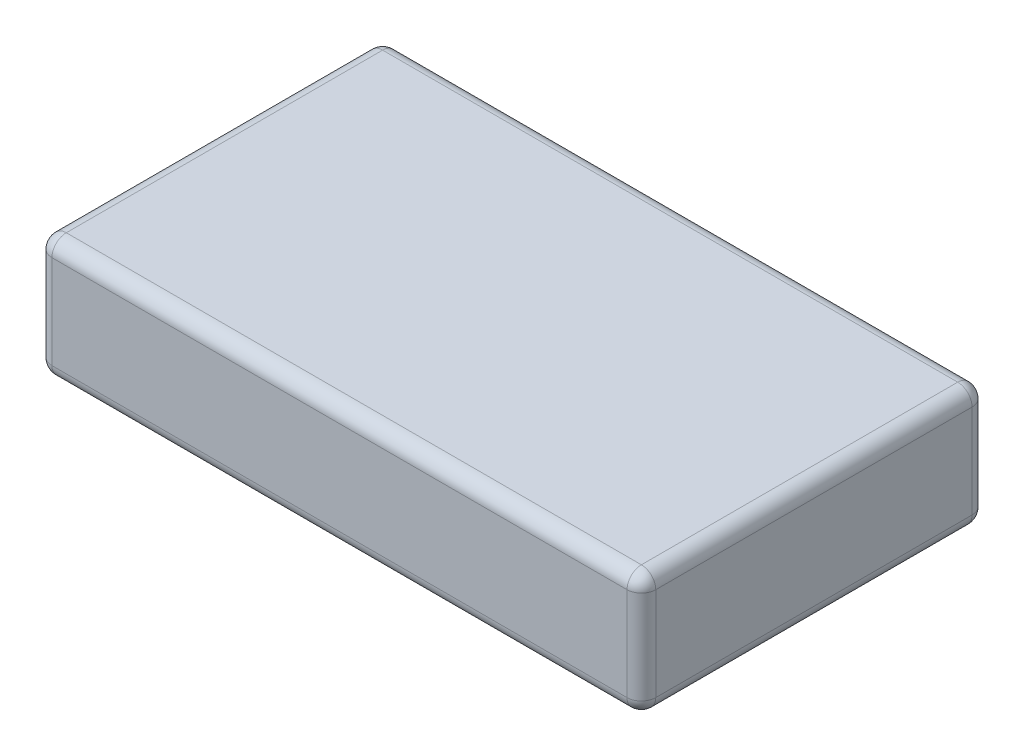
ISO-10303-21;
HEADER;
FILE_DESCRIPTION(('STEP AP214'),'2;1');
FILE_NAME('part.step','',(''),(''),'','','');
FILE_SCHEMA(('AUTOMOTIVE_DESIGN { 1 0 10303 214 1 1 1 1 }'));
ENDSEC;
DATA;
#1=APPLICATION_CONTEXT('core data for automotive mechanical design processes');
#2=APPLICATION_PROTOCOL_DEFINITION('international standard','automotive_design',2000,#1);
#3=PRODUCT_CONTEXT('',#1,'mechanical');
#4=PRODUCT('Part','Part','',(#3));
#5=PRODUCT_RELATED_PRODUCT_CATEGORY('part','',(#4));
#6=PRODUCT_DEFINITION_FORMATION('','',#4);
#7=PRODUCT_DEFINITION_CONTEXT('part definition',#1,'design');
#8=PRODUCT_DEFINITION('design','',#6,#7);
#9=PRODUCT_DEFINITION_SHAPE('','',#8);
#10=(LENGTH_UNIT() NAMED_UNIT(*) SI_UNIT(.MILLI.,.METRE.));
#11=(NAMED_UNIT(*) PLANE_ANGLE_UNIT() SI_UNIT($,.RADIAN.));
#12=(NAMED_UNIT(*) SI_UNIT($,.STERADIAN.) SOLID_ANGLE_UNIT());
#13=UNCERTAINTY_MEASURE_WITH_UNIT(LENGTH_MEASURE(1.E-05),#10,'distance_accuracy_value','');
#14=(GEOMETRIC_REPRESENTATION_CONTEXT(3) GLOBAL_UNCERTAINTY_ASSIGNED_CONTEXT((#13)) GLOBAL_UNIT_ASSIGNED_CONTEXT((#10,
#11,#12)) REPRESENTATION_CONTEXT('',''));
#15=CARTESIAN_POINT('',(0.,0.,0.));
#16=DIRECTION('',(0.,0.,1.));
#17=DIRECTION('',(1.,0.,0.));
#18=AXIS2_PLACEMENT_3D('',#15,#16,#17);
#19=CARTESIAN_POINT('',(-21.,8.5,-12.));
#20=DIRECTION('',(1.,0.,0.));
#21=DIRECTION('',(0.,0.,-1.));
#22=AXIS2_PLACEMENT_3D('',#19,#20,#21);
#23=PLANE('',#22);
#24=DIRECTION('',(0.,-1.,0.));
#25=VECTOR('',#24,1.);
#26=CARTESIAN_POINT('',(-21.,8.5,-11.));
#27=LINE('',#26,#25);
#28=CARTESIAN_POINT('',(-21.,7.5,-11.));
#29=VERTEX_POINT('',#28);
#30=CARTESIAN_POINT('',(-21.,1.,-11.));
#31=VERTEX_POINT('',#30);
#32=EDGE_CURVE('E277',#29,#31,#27,.T.);
#33=ORIENTED_EDGE('',*,*,#32,.T.);
#34=DIRECTION('',(0.,0.,1.));
#35=VECTOR('',#34,1.);
#36=CARTESIAN_POINT('',(-21.,1.,12.));
#37=LINE('',#36,#35);
#38=CARTESIAN_POINT('',(-21.,1.,11.));
#39=VERTEX_POINT('',#38);
#40=EDGE_CURVE('E212',#31,#39,#37,.T.);
#41=ORIENTED_EDGE('',*,*,#40,.T.);
#42=DIRECTION('',(0.,-1.,0.));
#43=VECTOR('',#42,1.);
#44=CARTESIAN_POINT('',(-21.,8.5,11.));
#45=LINE('',#44,#43);
#46=CARTESIAN_POINT('',(-21.,7.5,11.));
#47=VERTEX_POINT('',#46);
#48=EDGE_CURVE('E282',#39,#47,#45,.F.);
#49=ORIENTED_EDGE('',*,*,#48,.T.);
#50=DIRECTION('',(0.,0.,1.));
#51=VECTOR('',#50,1.);
#52=CARTESIAN_POINT('',(-21.,7.5,-12.));
#53=LINE('',#52,#51);
#54=EDGE_CURVE('E275',#47,#29,#53,.F.);
#55=ORIENTED_EDGE('',*,*,#54,.T.);
#56=EDGE_LOOP('',(#33,#41,#49,#55));
#57=FACE_BOUND('',#56,.T.);
#58=ADVANCED_FACE('F33',(#57),#23,.F.);
#59=CARTESIAN_POINT('',(21.,8.5,12.));
#60=DIRECTION('',(0.,0.,-1.));
#61=DIRECTION('',(-1.,0.,0.));
#62=AXIS2_PLACEMENT_3D('',#59,#60,#61);
#63=PLANE('',#62);
#64=DIRECTION('',(0.,-1.,0.));
#65=VECTOR('',#64,1.);
#66=CARTESIAN_POINT('',(-20.,8.5,12.));
#67=LINE('',#66,#65);
#68=CARTESIAN_POINT('',(-20.,7.5,12.));
#69=VERTEX_POINT('',#68);
#70=CARTESIAN_POINT('',(-20.,1.,12.));
#71=VERTEX_POINT('',#70);
#72=EDGE_CURVE('E131',#69,#71,#67,.T.);
#73=ORIENTED_EDGE('',*,*,#72,.T.);
#74=DIRECTION('',(1.,0.,0.));
#75=VECTOR('',#74,1.);
#76=CARTESIAN_POINT('',(21.,1.,12.));
#77=LINE('',#76,#75);
#78=CARTESIAN_POINT('',(20.,1.,12.));
#79=VERTEX_POINT('',#78);
#80=EDGE_CURVE('E127',#71,#79,#77,.T.);
#81=ORIENTED_EDGE('',*,*,#80,.T.);
#82=DIRECTION('',(0.,-1.,0.));
#83=VECTOR('',#82,1.);
#84=CARTESIAN_POINT('',(20.,8.5,12.));
#85=LINE('',#84,#83);
#86=CARTESIAN_POINT('',(20.,7.5,12.));
#87=VERTEX_POINT('',#86);
#88=EDGE_CURVE('E121',#79,#87,#85,.F.);
#89=ORIENTED_EDGE('',*,*,#88,.T.);
#90=DIRECTION('',(1.,0.,0.));
#91=VECTOR('',#90,1.);
#92=CARTESIAN_POINT('',(21.,7.5,12.));
#93=LINE('',#92,#91);
#94=EDGE_CURVE('E124',#87,#69,#93,.F.);
#95=ORIENTED_EDGE('',*,*,#94,.T.);
#96=EDGE_LOOP('',(#73,#81,#89,#95));
#97=FACE_BOUND('',#96,.T.);
#98=ADVANCED_FACE('F123',(#97),#63,.F.);
#99=CARTESIAN_POINT('',(21.,8.5,-12.));
#100=DIRECTION('',(-1.,0.,0.));
#101=DIRECTION('',(0.,0.,1.));
#102=AXIS2_PLACEMENT_3D('',#99,#100,#101);
#103=PLANE('',#102);
#104=DIRECTION('',(0.,0.,-1.));
#105=VECTOR('',#104,1.);
#106=CARTESIAN_POINT('',(21.,1.,-12.));
#107=LINE('',#106,#105);
#108=CARTESIAN_POINT('',(21.,1.,11.));
#109=VERTEX_POINT('',#108);
#110=CARTESIAN_POINT('',(21.,1.,-11.));
#111=VERTEX_POINT('',#110);
#112=EDGE_CURVE('E229',#109,#111,#107,.T.);
#113=ORIENTED_EDGE('',*,*,#112,.T.);
#114=DIRECTION('',(0.,-1.,0.));
#115=VECTOR('',#114,1.);
#116=CARTESIAN_POINT('',(21.,8.5,-11.));
#117=LINE('',#116,#115);
#118=CARTESIAN_POINT('',(21.,7.5,-11.));
#119=VERTEX_POINT('',#118);
#120=EDGE_CURVE('E231',#111,#119,#117,.F.);
#121=ORIENTED_EDGE('',*,*,#120,.T.);
#122=DIRECTION('',(0.,0.,-1.));
#123=VECTOR('',#122,1.);
#124=CARTESIAN_POINT('',(21.,7.5,-12.));
#125=LINE('',#124,#123);
#126=CARTESIAN_POINT('',(21.,7.5,11.));
#127=VERTEX_POINT('',#126);
#128=EDGE_CURVE('E222',#119,#127,#125,.F.);
#129=ORIENTED_EDGE('',*,*,#128,.T.);
#130=DIRECTION('',(0.,-1.,0.));
#131=VECTOR('',#130,1.);
#132=CARTESIAN_POINT('',(21.,8.5,11.));
#133=LINE('',#132,#131);
#134=EDGE_CURVE('E152',#127,#109,#133,.T.);
#135=ORIENTED_EDGE('',*,*,#134,.T.);
#136=EDGE_LOOP('',(#113,#121,#129,#135));
#137=FACE_BOUND('',#136,.T.);
#138=ADVANCED_FACE('F325',(#137),#103,.F.);
#139=CARTESIAN_POINT('',(21.,8.5,-12.));
#140=DIRECTION('',(0.,0.,1.));
#141=DIRECTION('',(1.,0.,0.));
#142=AXIS2_PLACEMENT_3D('',#139,#140,#141);
#143=PLANE('',#142);
#144=DIRECTION('',(-1.,0.,0.));
#145=VECTOR('',#144,1.);
#146=CARTESIAN_POINT('',(-21.,1.,-12.));
#147=LINE('',#146,#145);
#148=CARTESIAN_POINT('',(20.,1.,-12.));
#149=VERTEX_POINT('',#148);
#150=CARTESIAN_POINT('',(-20.,1.,-12.));
#151=VERTEX_POINT('',#150);
#152=EDGE_CURVE('E218',#149,#151,#147,.T.);
#153=ORIENTED_EDGE('',*,*,#152,.T.);
#154=DIRECTION('',(0.,-1.,0.));
#155=VECTOR('',#154,1.);
#156=CARTESIAN_POINT('',(-20.,8.5,-12.));
#157=LINE('',#156,#155);
#158=CARTESIAN_POINT('',(-20.,7.5,-12.));
#159=VERTEX_POINT('',#158);
#160=EDGE_CURVE('E215',#151,#159,#157,.F.);
#161=ORIENTED_EDGE('',*,*,#160,.T.);
#162=DIRECTION('',(-1.,0.,0.));
#163=VECTOR('',#162,1.);
#164=CARTESIAN_POINT('',(21.,7.5,-12.));
#165=LINE('',#164,#163);
#166=CARTESIAN_POINT('',(20.,7.5,-12.));
#167=VERTEX_POINT('',#166);
#168=EDGE_CURVE('E208',#159,#167,#165,.F.);
#169=ORIENTED_EDGE('',*,*,#168,.T.);
#170=DIRECTION('',(0.,-1.,0.));
#171=VECTOR('',#170,1.);
#172=CARTESIAN_POINT('',(20.,8.5,-12.));
#173=LINE('',#172,#171);
#174=EDGE_CURVE('E211',#167,#149,#173,.T.);
#175=ORIENTED_EDGE('',*,*,#174,.T.);
#176=EDGE_LOOP('',(#153,#161,#169,#175));
#177=FACE_BOUND('',#176,.T.);
#178=ADVANCED_FACE('F216',(#177),#143,.F.);
#179=CARTESIAN_POINT('',(0.,8.5,0.));
#180=DIRECTION('',(0.,-1.,0.));
#181=DIRECTION('',(0.,0.,-1.));
#182=AXIS2_PLACEMENT_3D('',#179,#180,#181);
#183=PLANE('',#182);
#184=DIRECTION('',(0.,0.,-1.));
#185=VECTOR('',#184,1.);
#186=CARTESIAN_POINT('',(20.,8.5,0.));
#187=LINE('',#186,#185);
#188=CARTESIAN_POINT('',(20.,8.5,11.));
#189=VERTEX_POINT('',#188);
#190=CARTESIAN_POINT('',(20.,8.5,-11.));
#191=VERTEX_POINT('',#190);
#192=EDGE_CURVE('E53',#189,#191,#187,.T.);
#193=ORIENTED_EDGE('',*,*,#192,.T.);
#194=DIRECTION('',(-1.,0.,0.));
#195=VECTOR('',#194,1.);
#196=CARTESIAN_POINT('',(0.,8.5,-11.));
#197=LINE('',#196,#195);
#198=CARTESIAN_POINT('',(-20.,8.5,-11.));
#199=VERTEX_POINT('',#198);
#200=EDGE_CURVE('E11',#191,#199,#197,.T.);
#201=ORIENTED_EDGE('',*,*,#200,.T.);
#202=DIRECTION('',(0.,0.,1.));
#203=VECTOR('',#202,1.);
#204=CARTESIAN_POINT('',(-20.,8.5,0.));
#205=LINE('',#204,#203);
#206=CARTESIAN_POINT('',(-20.,8.5,11.));
#207=VERTEX_POINT('',#206);
#208=EDGE_CURVE('E42',#199,#207,#205,.T.);
#209=ORIENTED_EDGE('',*,*,#208,.T.);
#210=DIRECTION('',(1.,0.,0.));
#211=VECTOR('',#210,1.);
#212=CARTESIAN_POINT('',(0.,8.5,11.));
#213=LINE('',#212,#211);
#214=EDGE_CURVE('E234',#207,#189,#213,.T.);
#215=ORIENTED_EDGE('',*,*,#214,.T.);
#216=EDGE_LOOP('',(#193,#201,#209,#215));
#217=FACE_BOUND('',#216,.T.);
#218=ADVANCED_FACE('F483',(#217),#183,.F.);
#219=CARTESIAN_POINT('',(0.,0.,0.));
#220=DIRECTION('',(0.,-1.,0.));
#221=DIRECTION('',(0.,0.,-1.));
#222=AXIS2_PLACEMENT_3D('',#219,#220,#221);
#223=PLANE('',#222);
#224=DIRECTION('',(0.,0.,-1.));
#225=VECTOR('',#224,1.);
#226=CARTESIAN_POINT('',(20.,0.,12.));
#227=LINE('',#226,#225);
#228=CARTESIAN_POINT('',(20.,0.,-11.));
#229=VERTEX_POINT('',#228);
#230=CARTESIAN_POINT('',(20.,0.,11.));
#231=VERTEX_POINT('',#230);
#232=EDGE_CURVE('E271',#229,#231,#227,.F.);
#233=ORIENTED_EDGE('',*,*,#232,.T.);
#234=DIRECTION('',(1.,0.,0.));
#235=VECTOR('',#234,1.);
#236=CARTESIAN_POINT('',(-21.,0.,11.));
#237=LINE('',#236,#235);
#238=CARTESIAN_POINT('',(-20.,0.,11.));
#239=VERTEX_POINT('',#238);
#240=EDGE_CURVE('E265',#231,#239,#237,.F.);
#241=ORIENTED_EDGE('',*,*,#240,.T.);
#242=DIRECTION('',(0.,0.,1.));
#243=VECTOR('',#242,1.);
#244=CARTESIAN_POINT('',(-20.,0.,-12.));
#245=LINE('',#244,#243);
#246=CARTESIAN_POINT('',(-20.,0.,-11.));
#247=VERTEX_POINT('',#246);
#248=EDGE_CURVE('E259',#239,#247,#245,.F.);
#249=ORIENTED_EDGE('',*,*,#248,.T.);
#250=DIRECTION('',(-1.,0.,0.));
#251=VECTOR('',#250,1.);
#252=CARTESIAN_POINT('',(21.,0.,-11.));
#253=LINE('',#252,#251);
#254=EDGE_CURVE('E266',#247,#229,#253,.F.);
#255=ORIENTED_EDGE('',*,*,#254,.T.);
#256=EDGE_LOOP('',(#233,#241,#249,#255));
#257=FACE_BOUND('',#256,.T.);
#258=ADVANCED_FACE('F269',(#257),#223,.T.);
#259=CARTESIAN_POINT('',(0.,7.5,-11.));
#260=DIRECTION('',(-1.,0.,0.));
#261=DIRECTION('',(0.,0.,1.));
#262=AXIS2_PLACEMENT_3D('',#259,#260,#261);
#263=CYLINDRICAL_SURFACE('',#262,1.);
#264=CARTESIAN_POINT('',(-20.,7.5,-11.));
#265=DIRECTION('',(-1.,0.,0.));
#266=DIRECTION('',(0.,0.,1.));
#267=AXIS2_PLACEMENT_3D('',#264,#265,#266);
#268=CIRCLE('',#267,1.);
#269=EDGE_CURVE('E37',#199,#159,#268,.T.);
#270=ORIENTED_EDGE('',*,*,#269,.F.);
#271=ORIENTED_EDGE('',*,*,#200,.F.);
#272=CARTESIAN_POINT('',(20.,7.5,-11.));
#273=DIRECTION('',(1.,0.,0.));
#274=DIRECTION('',(0.,0.,-1.));
#275=AXIS2_PLACEMENT_3D('',#272,#273,#274);
#276=CIRCLE('',#275,1.);
#277=EDGE_CURVE('E193',#167,#191,#276,.T.);
#278=ORIENTED_EDGE('',*,*,#277,.F.);
#279=ORIENTED_EDGE('',*,*,#168,.F.);
#280=EDGE_LOOP('',(#270,#271,#278,#279));
#281=FACE_BOUND('',#280,.T.);
#282=ADVANCED_FACE('F35',(#281),#263,.T.);
#283=CARTESIAN_POINT('',(-20.,7.5,-11.));
#284=DIRECTION('',(0.,0.,1.));
#285=DIRECTION('',(1.,0.,0.));
#286=AXIS2_PLACEMENT_3D('',#283,#284,#285);
#287=SPHERICAL_SURFACE('',#286,1.);
#288=CARTESIAN_POINT('',(-20.,7.5,-11.));
#289=DIRECTION('',(0.,0.,-1.));
#290=DIRECTION('',(-1.,0.,0.));
#291=AXIS2_PLACEMENT_3D('',#288,#289,#290);
#292=CIRCLE('',#291,1.);
#293=EDGE_CURVE('E189',#199,#29,#292,.F.);
#294=ORIENTED_EDGE('',*,*,#293,.F.);
#295=ORIENTED_EDGE('',*,*,#269,.T.);
#296=CARTESIAN_POINT('',(-20.,7.5,-11.));
#297=DIRECTION('',(0.,1.,0.));
#298=DIRECTION('',(0.,0.,1.));
#299=AXIS2_PLACEMENT_3D('',#296,#297,#298);
#300=CIRCLE('',#299,1.);
#301=EDGE_CURVE('E192',#29,#159,#300,.F.);
#302=ORIENTED_EDGE('',*,*,#301,.F.);
#303=EDGE_LOOP('',(#294,#295,#302));
#304=FACE_BOUND('',#303,.T.);
#305=ADVANCED_FACE('F204',(#304),#287,.T.);
#306=CARTESIAN_POINT('',(20.,7.5,-11.));
#307=DIRECTION('',(0.,0.,1.));
#308=DIRECTION('',(1.,0.,0.));
#309=AXIS2_PLACEMENT_3D('',#306,#307,#308);
#310=SPHERICAL_SURFACE('',#309,1.);
#311=CARTESIAN_POINT('',(20.,7.5,-11.));
#312=DIRECTION('',(0.,1.,0.));
#313=DIRECTION('',(0.,0.,1.));
#314=AXIS2_PLACEMENT_3D('',#311,#312,#313);
#315=CIRCLE('',#314,1.);
#316=EDGE_CURVE('E183',#167,#119,#315,.F.);
#317=ORIENTED_EDGE('',*,*,#316,.F.);
#318=ORIENTED_EDGE('',*,*,#277,.T.);
#319=CARTESIAN_POINT('',(20.,7.5,-11.));
#320=DIRECTION('',(0.,0.,-1.));
#321=DIRECTION('',(-1.,0.,0.));
#322=AXIS2_PLACEMENT_3D('',#319,#320,#321);
#323=CIRCLE('',#322,1.);
#324=EDGE_CURVE('E186',#119,#191,#323,.F.);
#325=ORIENTED_EDGE('',*,*,#324,.F.);
#326=EDGE_LOOP('',(#317,#318,#325));
#327=FACE_BOUND('',#326,.T.);
#328=ADVANCED_FACE('F456',(#327),#310,.T.);
#329=CARTESIAN_POINT('',(-20.,8.5,-11.));
#330=DIRECTION('',(0.,-1.,0.));
#331=DIRECTION('',(0.,0.,-1.));
#332=AXIS2_PLACEMENT_3D('',#329,#330,#331);
#333=CYLINDRICAL_SURFACE('',#332,1.);
#334=ORIENTED_EDGE('',*,*,#301,.T.);
#335=ORIENTED_EDGE('',*,*,#160,.F.);
#336=CARTESIAN_POINT('',(-20.,1.,-11.));
#337=DIRECTION('',(0.,-1.,0.));
#338=DIRECTION('',(0.,0.,-1.));
#339=AXIS2_PLACEMENT_3D('',#336,#337,#338);
#340=CIRCLE('',#339,1.);
#341=EDGE_CURVE('E177',#31,#151,#340,.T.);
#342=ORIENTED_EDGE('',*,*,#341,.F.);
#343=ORIENTED_EDGE('',*,*,#32,.F.);
#344=EDGE_LOOP('',(#334,#335,#342,#343));
#345=FACE_BOUND('',#344,.T.);
#346=ADVANCED_FACE('F307',(#345),#333,.T.);
#347=CARTESIAN_POINT('',(-20.,7.5,0.));
#348=DIRECTION('',(0.,0.,1.));
#349=DIRECTION('',(1.,0.,0.));
#350=AXIS2_PLACEMENT_3D('',#347,#348,#349);
#351=CYLINDRICAL_SURFACE('',#350,1.);
#352=ORIENTED_EDGE('',*,*,#293,.T.);
#353=ORIENTED_EDGE('',*,*,#54,.F.);
#354=CARTESIAN_POINT('',(-20.,7.5,11.));
#355=DIRECTION('',(0.,0.,1.));
#356=DIRECTION('',(1.,0.,0.));
#357=AXIS2_PLACEMENT_3D('',#354,#355,#356);
#358=CIRCLE('',#357,1.);
#359=EDGE_CURVE('E174',#207,#47,#358,.T.);
#360=ORIENTED_EDGE('',*,*,#359,.F.);
#361=ORIENTED_EDGE('',*,*,#208,.F.);
#362=EDGE_LOOP('',(#352,#353,#360,#361));
#363=FACE_BOUND('',#362,.T.);
#364=ADVANCED_FACE('F440',(#363),#351,.T.);
#365=CARTESIAN_POINT('',(0.,7.5,11.));
#366=DIRECTION('',(1.,0.,0.));
#367=DIRECTION('',(0.,0.,-1.));
#368=AXIS2_PLACEMENT_3D('',#365,#366,#367);
#369=CYLINDRICAL_SURFACE('',#368,1.);
#370=CARTESIAN_POINT('',(20.,7.5,11.));
#371=DIRECTION('',(1.,0.,0.));
#372=DIRECTION('',(0.,0.,-1.));
#373=AXIS2_PLACEMENT_3D('',#370,#371,#372);
#374=CIRCLE('',#373,1.);
#375=EDGE_CURVE('E138',#189,#87,#374,.T.);
#376=ORIENTED_EDGE('',*,*,#375,.F.);
#377=ORIENTED_EDGE('',*,*,#214,.F.);
#378=CARTESIAN_POINT('',(-20.,7.5,11.));
#379=DIRECTION('',(-1.,0.,0.));
#380=DIRECTION('',(0.,-1.,0.));
#381=AXIS2_PLACEMENT_3D('',#378,#379,#380);
#382=CIRCLE('',#381,1.);
#383=EDGE_CURVE('E140',#69,#207,#382,.T.);
#384=ORIENTED_EDGE('',*,*,#383,.F.);
#385=ORIENTED_EDGE('',*,*,#94,.F.);
#386=EDGE_LOOP('',(#376,#377,#384,#385));
#387=FACE_BOUND('',#386,.T.);
#388=ADVANCED_FACE('F136',(#387),#369,.T.);
#389=CARTESIAN_POINT('',(20.,7.5,0.));
#390=DIRECTION('',(0.,0.,-1.));
#391=DIRECTION('',(-1.,0.,0.));
#392=AXIS2_PLACEMENT_3D('',#389,#390,#391);
#393=CYLINDRICAL_SURFACE('',#392,1.);
#394=ORIENTED_EDGE('',*,*,#324,.T.);
#395=ORIENTED_EDGE('',*,*,#192,.F.);
#396=CARTESIAN_POINT('',(20.,7.5,11.));
#397=DIRECTION('',(0.,0.,1.));
#398=DIRECTION('',(1.,0.,0.));
#399=AXIS2_PLACEMENT_3D('',#396,#397,#398);
#400=CIRCLE('',#399,1.);
#401=EDGE_CURVE('E149',#127,#189,#400,.T.);
#402=ORIENTED_EDGE('',*,*,#401,.F.);
#403=ORIENTED_EDGE('',*,*,#128,.F.);
#404=EDGE_LOOP('',(#394,#395,#402,#403));
#405=FACE_BOUND('',#404,.T.);
#406=ADVANCED_FACE('F424',(#405),#393,.T.);
#407=CARTESIAN_POINT('',(20.,8.5,-11.));
#408=DIRECTION('',(0.,-1.,0.));
#409=DIRECTION('',(0.,0.,-1.));
#410=AXIS2_PLACEMENT_3D('',#407,#408,#409);
#411=CYLINDRICAL_SURFACE('',#410,1.);
#412=ORIENTED_EDGE('',*,*,#316,.T.);
#413=ORIENTED_EDGE('',*,*,#120,.F.);
#414=CARTESIAN_POINT('',(20.,1.,-11.));
#415=DIRECTION('',(0.,-1.,0.));
#416=DIRECTION('',(0.,0.,-1.));
#417=AXIS2_PLACEMENT_3D('',#414,#415,#416);
#418=CIRCLE('',#417,1.);
#419=EDGE_CURVE('E169',#149,#111,#418,.T.);
#420=ORIENTED_EDGE('',*,*,#419,.F.);
#421=ORIENTED_EDGE('',*,*,#174,.F.);
#422=EDGE_LOOP('',(#412,#413,#420,#421));
#423=FACE_BOUND('',#422,.T.);
#424=ADVANCED_FACE('F293',(#423),#411,.T.);
#425=CARTESIAN_POINT('',(21.,1.,-11.));
#426=DIRECTION('',(1.,0.,0.));
#427=DIRECTION('',(0.,0.,-1.));
#428=AXIS2_PLACEMENT_3D('',#425,#426,#427);
#429=CYLINDRICAL_SURFACE('',#428,1.);
#430=CARTESIAN_POINT('',(-20.,1.,-11.));
#431=DIRECTION('',(-1.,0.,0.));
#432=DIRECTION('',(0.,0.,1.));
#433=AXIS2_PLACEMENT_3D('',#430,#431,#432);
#434=CIRCLE('',#433,1.);
#435=EDGE_CURVE('E180',#151,#247,#434,.T.);
#436=ORIENTED_EDGE('',*,*,#435,.F.);
#437=ORIENTED_EDGE('',*,*,#152,.F.);
#438=CARTESIAN_POINT('',(20.,1.,-11.));
#439=DIRECTION('',(1.,0.,0.));
#440=DIRECTION('',(0.,0.,-1.));
#441=AXIS2_PLACEMENT_3D('',#438,#439,#440);
#442=CIRCLE('',#441,1.);
#443=EDGE_CURVE('E166',#229,#149,#442,.T.);
#444=ORIENTED_EDGE('',*,*,#443,.F.);
#445=ORIENTED_EDGE('',*,*,#254,.F.);
#446=EDGE_LOOP('',(#436,#437,#444,#445));
#447=FACE_BOUND('',#446,.T.);
#448=ADVANCED_FACE('F290',(#447),#429,.T.);
#449=CARTESIAN_POINT('',(-20.,1.,-11.));
#450=DIRECTION('',(0.,0.,1.));
#451=DIRECTION('',(1.,0.,0.));
#452=AXIS2_PLACEMENT_3D('',#449,#450,#451);
#453=SPHERICAL_SURFACE('',#452,1.);
#454=ORIENTED_EDGE('',*,*,#341,.T.);
#455=ORIENTED_EDGE('',*,*,#435,.T.);
#456=CARTESIAN_POINT('',(-20.,1.,-11.));
#457=DIRECTION('',(0.,0.,-1.));
#458=DIRECTION('',(-1.,0.,0.));
#459=AXIS2_PLACEMENT_3D('',#456,#457,#458);
#460=CIRCLE('',#459,1.);
#461=EDGE_CURVE('E157',#31,#247,#460,.F.);
#462=ORIENTED_EDGE('',*,*,#461,.F.);
#463=EDGE_LOOP('',(#454,#455,#462));
#464=FACE_BOUND('',#463,.T.);
#465=ADVANCED_FACE('F309',(#464),#453,.T.);
#466=CARTESIAN_POINT('',(-20.,7.5,11.));
#467=DIRECTION('',(0.,0.,1.));
#468=DIRECTION('',(1.,0.,0.));
#469=AXIS2_PLACEMENT_3D('',#466,#467,#468);
#470=SPHERICAL_SURFACE('',#469,1.);
#471=ORIENTED_EDGE('',*,*,#383,.T.);
#472=ORIENTED_EDGE('',*,*,#359,.T.);
#473=CARTESIAN_POINT('',(-20.,7.5,11.));
#474=DIRECTION('',(0.,1.,0.));
#475=DIRECTION('',(0.,0.,1.));
#476=AXIS2_PLACEMENT_3D('',#473,#474,#475);
#477=CIRCLE('',#476,1.);
#478=EDGE_CURVE('E153',#69,#47,#477,.F.);
#479=ORIENTED_EDGE('',*,*,#478,.F.);
#480=EDGE_LOOP('',(#471,#472,#479));
#481=FACE_BOUND('',#480,.T.);
#482=ADVANCED_FACE('F311',(#481),#470,.T.);
#483=CARTESIAN_POINT('',(20.,7.5,11.));
#484=DIRECTION('',(0.,0.,1.));
#485=DIRECTION('',(1.,0.,0.));
#486=AXIS2_PLACEMENT_3D('',#483,#484,#485);
#487=SPHERICAL_SURFACE('',#486,1.);
#488=ORIENTED_EDGE('',*,*,#401,.T.);
#489=ORIENTED_EDGE('',*,*,#375,.T.);
#490=CARTESIAN_POINT('',(20.,7.5,11.));
#491=DIRECTION('',(0.,1.,0.));
#492=DIRECTION('',(0.,0.,1.));
#493=AXIS2_PLACEMENT_3D('',#490,#491,#492);
#494=CIRCLE('',#493,1.);
#495=EDGE_CURVE('E146',#127,#87,#494,.F.);
#496=ORIENTED_EDGE('',*,*,#495,.F.);
#497=EDGE_LOOP('',(#488,#489,#496));
#498=FACE_BOUND('',#497,.T.);
#499=ADVANCED_FACE('F145',(#498),#487,.T.);
#500=CARTESIAN_POINT('',(20.,1.,-11.));
#501=DIRECTION('',(0.,0.,1.));
#502=DIRECTION('',(1.,0.,0.));
#503=AXIS2_PLACEMENT_3D('',#500,#501,#502);
#504=SPHERICAL_SURFACE('',#503,1.);
#505=ORIENTED_EDGE('',*,*,#443,.T.);
#506=ORIENTED_EDGE('',*,*,#419,.T.);
#507=CARTESIAN_POINT('',(20.,1.,-11.));
#508=DIRECTION('',(0.,0.,-1.));
#509=DIRECTION('',(-1.,0.,0.));
#510=AXIS2_PLACEMENT_3D('',#507,#508,#509);
#511=CIRCLE('',#510,1.);
#512=EDGE_CURVE('E154',#229,#111,#511,.F.);
#513=ORIENTED_EDGE('',*,*,#512,.F.);
#514=EDGE_LOOP('',(#505,#506,#513));
#515=FACE_BOUND('',#514,.T.);
#516=ADVANCED_FACE('F295',(#515),#504,.T.);
#517=CARTESIAN_POINT('',(-20.,1.,-12.));
#518=DIRECTION('',(0.,0.,-1.));
#519=DIRECTION('',(-1.,0.,0.));
#520=AXIS2_PLACEMENT_3D('',#517,#518,#519);
#521=CYLINDRICAL_SURFACE('',#520,1.);
#522=ORIENTED_EDGE('',*,*,#461,.T.);
#523=ORIENTED_EDGE('',*,*,#248,.F.);
#524=CARTESIAN_POINT('',(-20.,1.,11.));
#525=DIRECTION('',(0.,0.,1.));
#526=DIRECTION('',(1.,0.,0.));
#527=AXIS2_PLACEMENT_3D('',#524,#525,#526);
#528=CIRCLE('',#527,1.);
#529=EDGE_CURVE('E160',#39,#239,#528,.T.);
#530=ORIENTED_EDGE('',*,*,#529,.F.);
#531=ORIENTED_EDGE('',*,*,#40,.F.);
#532=EDGE_LOOP('',(#522,#523,#530,#531));
#533=FACE_BOUND('',#532,.T.);
#534=ADVANCED_FACE('F261',(#533),#521,.T.);
#535=CARTESIAN_POINT('',(-20.,8.5,11.));
#536=DIRECTION('',(0.,-1.,0.));
#537=DIRECTION('',(0.,0.,-1.));
#538=AXIS2_PLACEMENT_3D('',#535,#536,#537);
#539=CYLINDRICAL_SURFACE('',#538,1.);
#540=ORIENTED_EDGE('',*,*,#478,.T.);
#541=ORIENTED_EDGE('',*,*,#48,.F.);
#542=CARTESIAN_POINT('',(-20.,1.,11.));
#543=DIRECTION('',(0.,-1.,0.));
#544=DIRECTION('',(0.,0.,-1.));
#545=AXIS2_PLACEMENT_3D('',#542,#543,#544);
#546=CIRCLE('',#545,1.);
#547=EDGE_CURVE('E248',#71,#39,#546,.T.);
#548=ORIENTED_EDGE('',*,*,#547,.F.);
#549=ORIENTED_EDGE('',*,*,#72,.F.);
#550=EDGE_LOOP('',(#540,#541,#548,#549));
#551=FACE_BOUND('',#550,.T.);
#552=ADVANCED_FACE('F304',(#551),#539,.T.);
#553=CARTESIAN_POINT('',(20.,8.5,11.));
#554=DIRECTION('',(0.,-1.,0.));
#555=DIRECTION('',(0.,0.,-1.));
#556=AXIS2_PLACEMENT_3D('',#553,#554,#555);
#557=CYLINDRICAL_SURFACE('',#556,1.);
#558=ORIENTED_EDGE('',*,*,#495,.T.);
#559=ORIENTED_EDGE('',*,*,#88,.F.);
#560=CARTESIAN_POINT('',(20.,1.,11.));
#561=DIRECTION('',(0.,-1.,0.));
#562=DIRECTION('',(0.,0.,-1.));
#563=AXIS2_PLACEMENT_3D('',#560,#561,#562);
#564=CIRCLE('',#563,1.);
#565=EDGE_CURVE('E245',#109,#79,#564,.T.);
#566=ORIENTED_EDGE('',*,*,#565,.F.);
#567=ORIENTED_EDGE('',*,*,#134,.F.);
#568=EDGE_LOOP('',(#558,#559,#566,#567));
#569=FACE_BOUND('',#568,.T.);
#570=ADVANCED_FACE('F151',(#569),#557,.T.);
#571=CARTESIAN_POINT('',(20.,1.,-12.));
#572=DIRECTION('',(0.,0.,1.));
#573=DIRECTION('',(1.,0.,0.));
#574=AXIS2_PLACEMENT_3D('',#571,#572,#573);
#575=CYLINDRICAL_SURFACE('',#574,1.);
#576=ORIENTED_EDGE('',*,*,#512,.T.);
#577=ORIENTED_EDGE('',*,*,#112,.F.);
#578=CARTESIAN_POINT('',(20.,1.,11.));
#579=DIRECTION('',(0.,0.,1.));
#580=DIRECTION('',(1.,0.,0.));
#581=AXIS2_PLACEMENT_3D('',#578,#579,#580);
#582=CIRCLE('',#581,1.);
#583=EDGE_CURVE('E242',#231,#109,#582,.T.);
#584=ORIENTED_EDGE('',*,*,#583,.F.);
#585=ORIENTED_EDGE('',*,*,#232,.F.);
#586=EDGE_LOOP('',(#576,#577,#584,#585));
#587=FACE_BOUND('',#586,.T.);
#588=ADVANCED_FACE('F298',(#587),#575,.T.);
#589=CARTESIAN_POINT('',(-20.,1.,11.));
#590=DIRECTION('',(0.,0.,1.));
#591=DIRECTION('',(1.,0.,0.));
#592=AXIS2_PLACEMENT_3D('',#589,#590,#591);
#593=SPHERICAL_SURFACE('',#592,1.);
#594=ORIENTED_EDGE('',*,*,#547,.T.);
#595=ORIENTED_EDGE('',*,*,#529,.T.);
#596=CARTESIAN_POINT('',(-20.,1.,11.));
#597=DIRECTION('',(-1.,0.,0.));
#598=DIRECTION('',(0.,0.,1.));
#599=AXIS2_PLACEMENT_3D('',#596,#597,#598);
#600=CIRCLE('',#599,1.);
#601=EDGE_CURVE('E240',#71,#239,#600,.F.);
#602=ORIENTED_EDGE('',*,*,#601,.F.);
#603=EDGE_LOOP('',(#594,#595,#602));
#604=FACE_BOUND('',#603,.T.);
#605=ADVANCED_FACE('F254',(#604),#593,.T.);
#606=CARTESIAN_POINT('',(20.,1.,11.));
#607=DIRECTION('',(0.,0.,1.));
#608=DIRECTION('',(1.,0.,0.));
#609=AXIS2_PLACEMENT_3D('',#606,#607,#608);
#610=SPHERICAL_SURFACE('',#609,1.);
#611=ORIENTED_EDGE('',*,*,#583,.T.);
#612=ORIENTED_EDGE('',*,*,#565,.T.);
#613=CARTESIAN_POINT('',(20.,1.,11.));
#614=DIRECTION('',(1.,0.,0.));
#615=DIRECTION('',(0.,0.,-1.));
#616=AXIS2_PLACEMENT_3D('',#613,#614,#615);
#617=CIRCLE('',#616,1.);
#618=EDGE_CURVE('E238',#231,#79,#617,.F.);
#619=ORIENTED_EDGE('',*,*,#618,.F.);
#620=EDGE_LOOP('',(#611,#612,#619));
#621=FACE_BOUND('',#620,.T.);
#622=ADVANCED_FACE('F332',(#621),#610,.T.);
#623=CARTESIAN_POINT('',(21.,1.,11.));
#624=DIRECTION('',(-1.,0.,0.));
#625=DIRECTION('',(0.,0.,1.));
#626=AXIS2_PLACEMENT_3D('',#623,#624,#625);
#627=CYLINDRICAL_SURFACE('',#626,1.);
#628=ORIENTED_EDGE('',*,*,#601,.T.);
#629=ORIENTED_EDGE('',*,*,#240,.F.);
#630=ORIENTED_EDGE('',*,*,#618,.T.);
#631=ORIENTED_EDGE('',*,*,#80,.F.);
#632=EDGE_LOOP('',(#628,#629,#630,#631));
#633=FACE_BOUND('',#632,.T.);
#634=ADVANCED_FACE('F329',(#633),#627,.T.);
#635=CLOSED_SHELL('',(#58,#98,#138,#178,#218,#258,#282,#305,#328,#346,#364,#388,#406,#424,#448,
#465,#482,#499,#516,#534,#552,#570,#588,#605,#622,#634));
#636=MANIFOLD_SOLID_BREP('B2',#635);
#637=ADVANCED_BREP_SHAPE_REPRESENTATION('',(#18,#636),#14);
#638=SHAPE_DEFINITION_REPRESENTATION(#9,#637);
ENDSEC;
END-ISO-10303-21;
